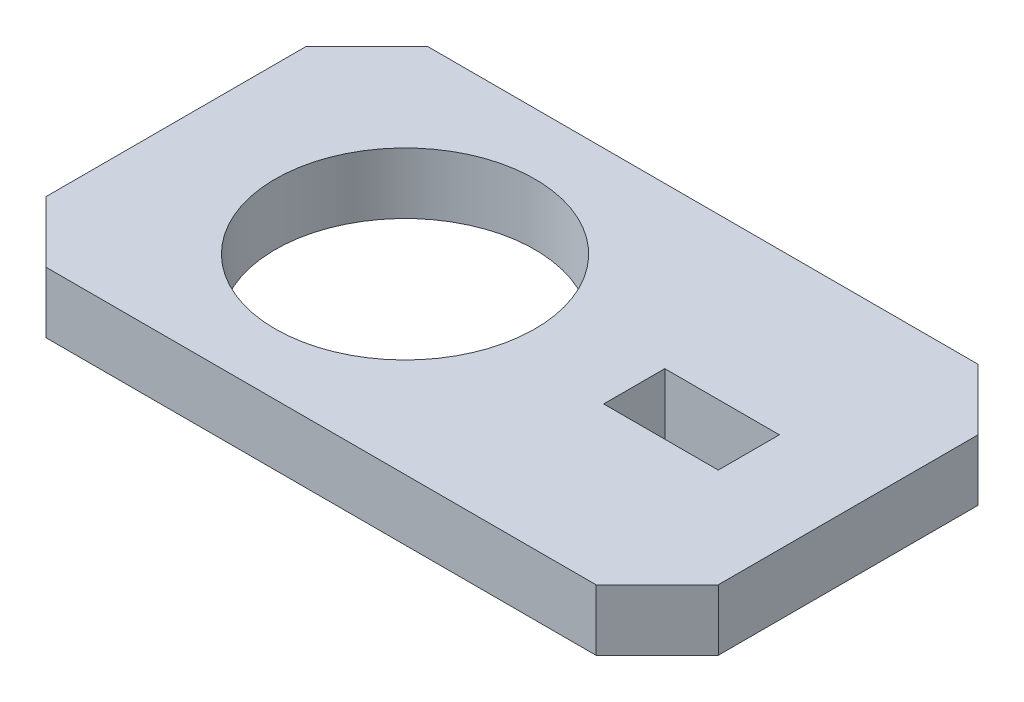
ISO-10303-21;
HEADER;
FILE_DESCRIPTION(('STEP AP214'),'2;1');
FILE_NAME('part.step','',(''),(''),'','','');
FILE_SCHEMA(('AUTOMOTIVE_DESIGN { 1 0 10303 214 1 1 1 1 }'));
ENDSEC;
DATA;
#1=APPLICATION_CONTEXT('core data for automotive mechanical design processes');
#2=APPLICATION_PROTOCOL_DEFINITION('international standard','automotive_design',2000,#1);
#3=PRODUCT_CONTEXT('',#1,'mechanical');
#4=PRODUCT('Part','Part','',(#3));
#5=PRODUCT_RELATED_PRODUCT_CATEGORY('part','',(#4));
#6=PRODUCT_DEFINITION_FORMATION('','',#4);
#7=PRODUCT_DEFINITION_CONTEXT('part definition',#1,'design');
#8=PRODUCT_DEFINITION('design','',#6,#7);
#9=PRODUCT_DEFINITION_SHAPE('','',#8);
#10=(LENGTH_UNIT() NAMED_UNIT(*) SI_UNIT(.MILLI.,.METRE.));
#11=(NAMED_UNIT(*) PLANE_ANGLE_UNIT() SI_UNIT($,.RADIAN.));
#12=(NAMED_UNIT(*) SI_UNIT($,.STERADIAN.) SOLID_ANGLE_UNIT());
#13=UNCERTAINTY_MEASURE_WITH_UNIT(LENGTH_MEASURE(1.E-05),#10,'distance_accuracy_value','');
#14=(GEOMETRIC_REPRESENTATION_CONTEXT(3) GLOBAL_UNCERTAINTY_ASSIGNED_CONTEXT((#13)) GLOBAL_UNIT_ASSIGNED_CONTEXT((#10,
#11,#12)) REPRESENTATION_CONTEXT('',''));
#15=CARTESIAN_POINT('',(0.,0.,0.));
#16=DIRECTION('',(0.,0.,1.));
#17=DIRECTION('',(1.,0.,0.));
#18=AXIS2_PLACEMENT_3D('',#15,#16,#17);
#19=CARTESIAN_POINT('',(0.,4.,0.));
#20=DIRECTION('',(0.,-1.,0.));
#21=DIRECTION('',(0.,0.,-1.));
#22=AXIS2_PLACEMENT_3D('',#19,#20,#21);
#23=PLANE('',#22);
#24=CARTESIAN_POINT('',(15.,4.,-12.5));
#25=DIRECTION('',(0.,1.,0.));
#26=DIRECTION('',(0.,0.,1.));
#27=AXIS2_PLACEMENT_3D('',#24,#25,#26);
#28=CIRCLE('',#27,8.5);
#29=CARTESIAN_POINT('',(15.,4.,-4.));
#30=VERTEX_POINT('',#29);
#31=EDGE_CURVE('E189',#30,#30,#28,.T.);
#32=ORIENTED_EDGE('',*,*,#31,.F.);
#33=EDGE_LOOP('',(#32));
#34=FACE_BOUND('',#33,.T.);
#35=DIRECTION('',(0.,0.,1.));
#36=VECTOR('',#35,1.);
#37=CARTESIAN_POINT('',(0.,4.,0.));
#38=LINE('',#37,#36);
#39=CARTESIAN_POINT('',(0.,4.,-21.));
#40=VERTEX_POINT('',#39);
#41=CARTESIAN_POINT('',(0.,4.,-4.00000000000002));
#42=VERTEX_POINT('',#41);
#43=EDGE_CURVE('E197',#40,#42,#38,.T.);
#44=ORIENTED_EDGE('',*,*,#43,.T.);
#45=DIRECTION('',(-0.707106781186546,0.,-0.707106781186549));
#46=VECTOR('',#45,1.);
#47=CARTESIAN_POINT('',(4.,4.,0.));
#48=LINE('',#47,#46);
#49=CARTESIAN_POINT('',(4.,4.,0.));
#50=VERTEX_POINT('',#49);
#51=EDGE_CURVE('E259',#42,#50,#48,.F.);
#52=ORIENTED_EDGE('',*,*,#51,.T.);
#53=DIRECTION('',(1.,0.,0.));
#54=VECTOR('',#53,1.);
#55=CARTESIAN_POINT('',(0.,4.,0.));
#56=LINE('',#55,#54);
#57=CARTESIAN_POINT('',(40.,4.,0.));
#58=VERTEX_POINT('',#57);
#59=EDGE_CURVE('E201',#50,#58,#56,.T.);
#60=ORIENTED_EDGE('',*,*,#59,.T.);
#61=DIRECTION('',(-0.707106781186549,0.,0.707106781186546));
#62=VECTOR('',#61,1.);
#63=CARTESIAN_POINT('',(44.,4.,-4.));
#64=LINE('',#63,#62);
#65=CARTESIAN_POINT('',(44.,4.,-4.));
#66=VERTEX_POINT('',#65);
#67=EDGE_CURVE('E251',#58,#66,#64,.F.);
#68=ORIENTED_EDGE('',*,*,#67,.T.);
#69=DIRECTION('',(0.,0.,-1.));
#70=VECTOR('',#69,1.);
#71=CARTESIAN_POINT('',(44.,4.,0.));
#72=LINE('',#71,#70);
#73=CARTESIAN_POINT('',(44.,4.,-21.));
#74=VERTEX_POINT('',#73);
#75=EDGE_CURVE('E206',#66,#74,#72,.T.);
#76=ORIENTED_EDGE('',*,*,#75,.T.);
#77=DIRECTION('',(0.707106781186546,0.,0.707106781186549));
#78=VECTOR('',#77,1.);
#79=CARTESIAN_POINT('',(40.,4.,-25.));
#80=LINE('',#79,#78);
#81=CARTESIAN_POINT('',(40.,4.,-25.));
#82=VERTEX_POINT('',#81);
#83=EDGE_CURVE('E66',#74,#82,#80,.F.);
#84=ORIENTED_EDGE('',*,*,#83,.T.);
#85=DIRECTION('',(-1.,0.,0.));
#86=VECTOR('',#85,1.);
#87=CARTESIAN_POINT('',(0.,4.,-25.));
#88=LINE('',#87,#86);
#89=CARTESIAN_POINT('',(4.00000000000002,4.,-25.));
#90=VERTEX_POINT('',#89);
#91=EDGE_CURVE('E209',#82,#90,#88,.T.);
#92=ORIENTED_EDGE('',*,*,#91,.T.);
#93=DIRECTION('',(0.707106781186549,0.,-0.707106781186546));
#94=VECTOR('',#93,1.);
#95=CARTESIAN_POINT('',(0.,4.,-21.));
#96=LINE('',#95,#94);
#97=EDGE_CURVE('E256',#90,#40,#96,.F.);
#98=ORIENTED_EDGE('',*,*,#97,.T.);
#99=EDGE_LOOP('',(#44,#52,#60,#68,#76,#84,#92,#98));
#100=FACE_BOUND('',#99,.T.);
#101=DIRECTION('',(0.,0.,1.));
#102=VECTOR('',#101,1.);
#103=CARTESIAN_POINT('',(30.,4.,-10.5));
#104=LINE('',#103,#102);
#105=CARTESIAN_POINT('',(30.,4.,-14.5));
#106=VERTEX_POINT('',#105);
#107=CARTESIAN_POINT('',(30.,4.,-10.5));
#108=VERTEX_POINT('',#107);
#109=EDGE_CURVE('E135',#106,#108,#104,.T.);
#110=ORIENTED_EDGE('',*,*,#109,.F.);
#111=DIRECTION('',(-1.,0.,0.));
#112=VECTOR('',#111,1.);
#113=CARTESIAN_POINT('',(30.,4.,-14.5));
#114=LINE('',#113,#112);
#115=CARTESIAN_POINT('',(37.5,4.,-14.5));
#116=VERTEX_POINT('',#115);
#117=EDGE_CURVE('E165',#116,#106,#114,.T.);
#118=ORIENTED_EDGE('',*,*,#117,.F.);
#119=DIRECTION('',(0.,0.,-1.));
#120=VECTOR('',#119,1.);
#121=CARTESIAN_POINT('',(37.5,4.,-10.5));
#122=LINE('',#121,#120);
#123=CARTESIAN_POINT('',(37.5,4.,-10.5));
#124=VERTEX_POINT('',#123);
#125=EDGE_CURVE('E160',#124,#116,#122,.T.);
#126=ORIENTED_EDGE('',*,*,#125,.F.);
#127=DIRECTION('',(1.,0.,0.));
#128=VECTOR('',#127,1.);
#129=CARTESIAN_POINT('',(30.,4.,-10.5));
#130=LINE('',#129,#128);
#131=EDGE_CURVE('E146',#108,#124,#130,.T.);
#132=ORIENTED_EDGE('',*,*,#131,.F.);
#133=EDGE_LOOP('',(#110,#118,#126,#132));
#134=FACE_BOUND('',#133,.T.);
#135=ADVANCED_FACE('F42',(#34,#100,#134),#23,.F.);
#136=CARTESIAN_POINT('',(0.,0.,0.));
#137=DIRECTION('',(0.,-1.,0.));
#138=DIRECTION('',(0.,0.,-1.));
#139=AXIS2_PLACEMENT_3D('',#136,#137,#138);
#140=PLANE('',#139);
#141=DIRECTION('',(1.,0.,0.));
#142=VECTOR('',#141,1.);
#143=CARTESIAN_POINT('',(0.,0.,0.));
#144=LINE('',#143,#142);
#145=CARTESIAN_POINT('',(4.,0.,0.));
#146=VERTEX_POINT('',#145);
#147=CARTESIAN_POINT('',(40.,0.,0.));
#148=VERTEX_POINT('',#147);
#149=EDGE_CURVE('E216',#146,#148,#144,.T.);
#150=ORIENTED_EDGE('',*,*,#149,.F.);
#151=DIRECTION('',(0.707106781186546,0.,0.707106781186549));
#152=VECTOR('',#151,1.);
#153=CARTESIAN_POINT('',(2.00000000000001,0.,-2.));
#154=LINE('',#153,#152);
#155=CARTESIAN_POINT('',(0.,0.,-4.00000000000002));
#156=VERTEX_POINT('',#155);
#157=EDGE_CURVE('E241',#146,#156,#154,.F.);
#158=ORIENTED_EDGE('',*,*,#157,.T.);
#159=DIRECTION('',(0.,0.,1.));
#160=VECTOR('',#159,1.);
#161=CARTESIAN_POINT('',(0.,0.,0.));
#162=LINE('',#161,#160);
#163=CARTESIAN_POINT('',(0.,0.,-21.));
#164=VERTEX_POINT('',#163);
#165=EDGE_CURVE('E193',#164,#156,#162,.T.);
#166=ORIENTED_EDGE('',*,*,#165,.F.);
#167=DIRECTION('',(-0.707106781186549,0.,0.707106781186546));
#168=VECTOR('',#167,1.);
#169=CARTESIAN_POINT('',(-10.5,0.,-10.5));
#170=LINE('',#169,#168);
#171=CARTESIAN_POINT('',(4.00000000000002,0.,-25.));
#172=VERTEX_POINT('',#171);
#173=EDGE_CURVE('E238',#164,#172,#170,.F.);
#174=ORIENTED_EDGE('',*,*,#173,.T.);
#175=DIRECTION('',(-1.,0.,0.));
#176=VECTOR('',#175,1.);
#177=CARTESIAN_POINT('',(0.,0.,-25.));
#178=LINE('',#177,#176);
#179=CARTESIAN_POINT('',(40.,0.,-25.));
#180=VERTEX_POINT('',#179);
#181=EDGE_CURVE('E202',#180,#172,#178,.T.);
#182=ORIENTED_EDGE('',*,*,#181,.F.);
#183=DIRECTION('',(-0.707106781186546,0.,-0.707106781186549));
#184=VECTOR('',#183,1.);
#185=CARTESIAN_POINT('',(32.5000000000001,0.,-32.5));
#186=LINE('',#185,#184);
#187=CARTESIAN_POINT('',(44.,0.,-21.));
#188=VERTEX_POINT('',#187);
#189=EDGE_CURVE('E235',#180,#188,#186,.F.);
#190=ORIENTED_EDGE('',*,*,#189,.T.);
#191=DIRECTION('',(0.,0.,-1.));
#192=VECTOR('',#191,1.);
#193=CARTESIAN_POINT('',(44.,0.,0.));
#194=LINE('',#193,#192);
#195=CARTESIAN_POINT('',(44.,0.,-4.));
#196=VERTEX_POINT('',#195);
#197=EDGE_CURVE('E220',#196,#188,#194,.T.);
#198=ORIENTED_EDGE('',*,*,#197,.F.);
#199=DIRECTION('',(0.707106781186549,0.,-0.707106781186546));
#200=VECTOR('',#199,1.);
#201=CARTESIAN_POINT('',(19.9999999999999,0.,20.));
#202=LINE('',#201,#200);
#203=EDGE_CURVE('E232',#196,#148,#202,.F.);
#204=ORIENTED_EDGE('',*,*,#203,.T.);
#205=EDGE_LOOP('',(#150,#158,#166,#174,#182,#190,#198,#204));
#206=FACE_BOUND('',#205,.T.);
#207=CARTESIAN_POINT('',(15.,0.,-12.5));
#208=DIRECTION('',(0.,1.,0.));
#209=DIRECTION('',(0.,0.,1.));
#210=AXIS2_PLACEMENT_3D('',#207,#208,#209);
#211=CIRCLE('',#210,8.5);
#212=CARTESIAN_POINT('',(15.,0.,-4.));
#213=VERTEX_POINT('',#212);
#214=EDGE_CURVE('E155',#213,#213,#211,.T.);
#215=ORIENTED_EDGE('',*,*,#214,.T.);
#216=EDGE_LOOP('',(#215));
#217=FACE_BOUND('',#216,.T.);
#218=DIRECTION('',(-1.,0.,0.));
#219=VECTOR('',#218,1.);
#220=CARTESIAN_POINT('',(30.,0.,-14.5));
#221=LINE('',#220,#219);
#222=CARTESIAN_POINT('',(37.5,0.,-14.5));
#223=VERTEX_POINT('',#222);
#224=CARTESIAN_POINT('',(30.,0.,-14.5));
#225=VERTEX_POINT('',#224);
#226=EDGE_CURVE('E147',#223,#225,#221,.T.);
#227=ORIENTED_EDGE('',*,*,#226,.T.);
#228=DIRECTION('',(0.,0.,1.));
#229=VECTOR('',#228,1.);
#230=CARTESIAN_POINT('',(30.,0.,-10.5));
#231=LINE('',#230,#229);
#232=CARTESIAN_POINT('',(30.,0.,-10.5));
#233=VERTEX_POINT('',#232);
#234=EDGE_CURVE('E170',#225,#233,#231,.T.);
#235=ORIENTED_EDGE('',*,*,#234,.T.);
#236=DIRECTION('',(1.,0.,0.));
#237=VECTOR('',#236,1.);
#238=CARTESIAN_POINT('',(30.,0.,-10.5));
#239=LINE('',#238,#237);
#240=CARTESIAN_POINT('',(37.5,0.,-10.5));
#241=VERTEX_POINT('',#240);
#242=EDGE_CURVE('E153',#233,#241,#239,.T.);
#243=ORIENTED_EDGE('',*,*,#242,.T.);
#244=DIRECTION('',(0.,0.,-1.));
#245=VECTOR('',#244,1.);
#246=CARTESIAN_POINT('',(37.5,0.,-10.5));
#247=LINE('',#246,#245);
#248=EDGE_CURVE('E175',#241,#223,#247,.T.);
#249=ORIENTED_EDGE('',*,*,#248,.T.);
#250=EDGE_LOOP('',(#227,#235,#243,#249));
#251=FACE_BOUND('',#250,.T.);
#252=ADVANCED_FACE('F280',(#206,#217,#251),#140,.T.);
#253=CARTESIAN_POINT('',(0.,4.,0.));
#254=DIRECTION('',(1.,0.,0.));
#255=DIRECTION('',(0.,0.,-1.));
#256=AXIS2_PLACEMENT_3D('',#253,#254,#255);
#257=PLANE('',#256);
#258=ORIENTED_EDGE('',*,*,#165,.T.);
#259=DIRECTION('',(0.,1.,0.));
#260=VECTOR('',#259,1.);
#261=CARTESIAN_POINT('',(0.,4.,-4.00000000000002));
#262=LINE('',#261,#260);
#263=EDGE_CURVE('E248',#156,#42,#262,.T.);
#264=ORIENTED_EDGE('',*,*,#263,.T.);
#265=ORIENTED_EDGE('',*,*,#43,.F.);
#266=DIRECTION('',(0.,-1.,0.));
#267=VECTOR('',#266,1.);
#268=CARTESIAN_POINT('',(0.,4.,-21.));
#269=LINE('',#268,#267);
#270=EDGE_CURVE('E244',#40,#164,#269,.T.);
#271=ORIENTED_EDGE('',*,*,#270,.T.);
#272=EDGE_LOOP('',(#258,#264,#265,#271));
#273=FACE_BOUND('',#272,.T.);
#274=ADVANCED_FACE('F294',(#273),#257,.F.);
#275=CARTESIAN_POINT('',(0.,4.,0.));
#276=DIRECTION('',(0.,0.,-1.));
#277=DIRECTION('',(-1.,0.,0.));
#278=AXIS2_PLACEMENT_3D('',#275,#276,#277);
#279=PLANE('',#278);
#280=ORIENTED_EDGE('',*,*,#59,.F.);
#281=DIRECTION('',(0.,-1.,0.));
#282=VECTOR('',#281,1.);
#283=CARTESIAN_POINT('',(4.,4.,0.));
#284=LINE('',#283,#282);
#285=EDGE_CURVE('E228',#50,#146,#284,.T.);
#286=ORIENTED_EDGE('',*,*,#285,.T.);
#287=ORIENTED_EDGE('',*,*,#149,.T.);
#288=DIRECTION('',(0.,1.,0.));
#289=VECTOR('',#288,1.);
#290=CARTESIAN_POINT('',(40.,4.,0.));
#291=LINE('',#290,#289);
#292=EDGE_CURVE('E212',#148,#58,#291,.T.);
#293=ORIENTED_EDGE('',*,*,#292,.T.);
#294=EDGE_LOOP('',(#280,#286,#287,#293));
#295=FACE_BOUND('',#294,.T.);
#296=ADVANCED_FACE('F302',(#295),#279,.F.);
#297=CARTESIAN_POINT('',(44.,4.,0.));
#298=DIRECTION('',(-1.,0.,0.));
#299=DIRECTION('',(0.,0.,1.));
#300=AXIS2_PLACEMENT_3D('',#297,#298,#299);
#301=PLANE('',#300);
#302=ORIENTED_EDGE('',*,*,#197,.T.);
#303=DIRECTION('',(0.,1.,0.));
#304=VECTOR('',#303,1.);
#305=CARTESIAN_POINT('',(44.,4.,-21.));
#306=LINE('',#305,#304);
#307=EDGE_CURVE('E11',#188,#74,#306,.T.);
#308=ORIENTED_EDGE('',*,*,#307,.T.);
#309=ORIENTED_EDGE('',*,*,#75,.F.);
#310=DIRECTION('',(0.,-1.,0.));
#311=VECTOR('',#310,1.);
#312=CARTESIAN_POINT('',(44.,4.,-4.));
#313=LINE('',#312,#311);
#314=EDGE_CURVE('E52',#66,#196,#313,.T.);
#315=ORIENTED_EDGE('',*,*,#314,.T.);
#316=EDGE_LOOP('',(#302,#308,#309,#315));
#317=FACE_BOUND('',#316,.T.);
#318=ADVANCED_FACE('F274',(#317),#301,.F.);
#319=CARTESIAN_POINT('',(0.,4.,-25.));
#320=DIRECTION('',(0.,0.,1.));
#321=DIRECTION('',(1.,0.,0.));
#322=AXIS2_PLACEMENT_3D('',#319,#320,#321);
#323=PLANE('',#322);
#324=ORIENTED_EDGE('',*,*,#181,.T.);
#325=DIRECTION('',(0.,1.,0.));
#326=VECTOR('',#325,1.);
#327=CARTESIAN_POINT('',(4.00000000000002,4.,-25.));
#328=LINE('',#327,#326);
#329=EDGE_CURVE('E59',#172,#90,#328,.T.);
#330=ORIENTED_EDGE('',*,*,#329,.T.);
#331=ORIENTED_EDGE('',*,*,#91,.F.);
#332=DIRECTION('',(0.,-1.,0.));
#333=VECTOR('',#332,1.);
#334=CARTESIAN_POINT('',(40.,4.,-25.));
#335=LINE('',#334,#333);
#336=EDGE_CURVE('E262',#82,#180,#335,.T.);
#337=ORIENTED_EDGE('',*,*,#336,.T.);
#338=EDGE_LOOP('',(#324,#330,#331,#337));
#339=FACE_BOUND('',#338,.T.);
#340=ADVANCED_FACE('F286',(#339),#323,.F.);
#341=CARTESIAN_POINT('',(15.,4.,-12.5));
#342=DIRECTION('',(0.,-1.,0.));
#343=DIRECTION('',(0.,0.,-1.));
#344=AXIS2_PLACEMENT_3D('',#341,#342,#343);
#345=CYLINDRICAL_SURFACE('',#344,8.5);
#346=ORIENTED_EDGE('',*,*,#31,.T.);
#347=EDGE_LOOP('',(#346));
#348=FACE_BOUND('',#347,.T.);
#349=ORIENTED_EDGE('',*,*,#214,.F.);
#350=EDGE_LOOP('',(#349));
#351=FACE_BOUND('',#350,.T.);
#352=ADVANCED_FACE('F317',(#348,#351),#345,.F.);
#353=CARTESIAN_POINT('',(30.,4.,-10.5));
#354=DIRECTION('',(1.,0.,0.));
#355=DIRECTION('',(0.,0.,-1.));
#356=AXIS2_PLACEMENT_3D('',#353,#354,#355);
#357=PLANE('',#356);
#358=ORIENTED_EDGE('',*,*,#234,.F.);
#359=DIRECTION('',(0.,-1.,0.));
#360=VECTOR('',#359,1.);
#361=CARTESIAN_POINT('',(30.,4.,-14.5));
#362=LINE('',#361,#360);
#363=EDGE_CURVE('E141',#106,#225,#362,.T.);
#364=ORIENTED_EDGE('',*,*,#363,.F.);
#365=ORIENTED_EDGE('',*,*,#109,.T.);
#366=DIRECTION('',(0.,-1.,0.));
#367=VECTOR('',#366,1.);
#368=CARTESIAN_POINT('',(30.,4.,-10.5));
#369=LINE('',#368,#367);
#370=EDGE_CURVE('E138',#108,#233,#369,.T.);
#371=ORIENTED_EDGE('',*,*,#370,.T.);
#372=EDGE_LOOP('',(#358,#364,#365,#371));
#373=FACE_BOUND('',#372,.T.);
#374=ADVANCED_FACE('F137',(#373),#357,.T.);
#375=CARTESIAN_POINT('',(30.,4.,-10.5));
#376=DIRECTION('',(0.,0.,-1.));
#377=DIRECTION('',(-1.,0.,0.));
#378=AXIS2_PLACEMENT_3D('',#375,#376,#377);
#379=PLANE('',#378);
#380=ORIENTED_EDGE('',*,*,#242,.F.);
#381=ORIENTED_EDGE('',*,*,#370,.F.);
#382=ORIENTED_EDGE('',*,*,#131,.T.);
#383=DIRECTION('',(0.,-1.,0.));
#384=VECTOR('',#383,1.);
#385=CARTESIAN_POINT('',(37.5,4.,-10.5));
#386=LINE('',#385,#384);
#387=EDGE_CURVE('E156',#124,#241,#386,.T.);
#388=ORIENTED_EDGE('',*,*,#387,.T.);
#389=EDGE_LOOP('',(#380,#381,#382,#388));
#390=FACE_BOUND('',#389,.T.);
#391=ADVANCED_FACE('F150',(#390),#379,.T.);
#392=CARTESIAN_POINT('',(37.5,4.,-10.5));
#393=DIRECTION('',(-1.,0.,0.));
#394=DIRECTION('',(0.,0.,1.));
#395=AXIS2_PLACEMENT_3D('',#392,#393,#394);
#396=PLANE('',#395);
#397=ORIENTED_EDGE('',*,*,#248,.F.);
#398=ORIENTED_EDGE('',*,*,#387,.F.);
#399=ORIENTED_EDGE('',*,*,#125,.T.);
#400=DIRECTION('',(0.,-1.,0.));
#401=VECTOR('',#400,1.);
#402=CARTESIAN_POINT('',(37.5,4.,-14.5));
#403=LINE('',#402,#401);
#404=EDGE_CURVE('E184',#116,#223,#403,.T.);
#405=ORIENTED_EDGE('',*,*,#404,.T.);
#406=EDGE_LOOP('',(#397,#398,#399,#405));
#407=FACE_BOUND('',#406,.T.);
#408=ADVANCED_FACE('F379',(#407),#396,.T.);
#409=CARTESIAN_POINT('',(30.,4.,-14.5));
#410=DIRECTION('',(0.,0.,1.));
#411=DIRECTION('',(1.,0.,0.));
#412=AXIS2_PLACEMENT_3D('',#409,#410,#411);
#413=PLANE('',#412);
#414=ORIENTED_EDGE('',*,*,#226,.F.);
#415=ORIENTED_EDGE('',*,*,#404,.F.);
#416=ORIENTED_EDGE('',*,*,#117,.T.);
#417=ORIENTED_EDGE('',*,*,#363,.T.);
#418=EDGE_LOOP('',(#414,#415,#416,#417));
#419=FACE_BOUND('',#418,.T.);
#420=ADVANCED_FACE('F334',(#419),#413,.T.);
#421=CARTESIAN_POINT('',(4.,4.,0.));
#422=DIRECTION('',(0.707106781186549,0.,-0.707106781186546));
#423=DIRECTION('',(0.,-1.,0.));
#424=AXIS2_PLACEMENT_3D('',#421,#422,#423);
#425=PLANE('',#424);
#426=ORIENTED_EDGE('',*,*,#51,.F.);
#427=ORIENTED_EDGE('',*,*,#263,.F.);
#428=ORIENTED_EDGE('',*,*,#157,.F.);
#429=ORIENTED_EDGE('',*,*,#285,.F.);
#430=EDGE_LOOP('',(#426,#427,#428,#429));
#431=FACE_BOUND('',#430,.T.);
#432=ADVANCED_FACE('F299',(#431),#425,.F.);
#433=CARTESIAN_POINT('',(0.,4.,-21.));
#434=DIRECTION('',(0.707106781186546,0.,0.707106781186549));
#435=DIRECTION('',(0.,-1.,0.));
#436=AXIS2_PLACEMENT_3D('',#433,#434,#435);
#437=PLANE('',#436);
#438=ORIENTED_EDGE('',*,*,#97,.F.);
#439=ORIENTED_EDGE('',*,*,#329,.F.);
#440=ORIENTED_EDGE('',*,*,#173,.F.);
#441=ORIENTED_EDGE('',*,*,#270,.F.);
#442=EDGE_LOOP('',(#438,#439,#440,#441));
#443=FACE_BOUND('',#442,.T.);
#444=ADVANCED_FACE('F291',(#443),#437,.F.);
#445=CARTESIAN_POINT('',(40.,4.,-25.));
#446=DIRECTION('',(-0.707106781186549,0.,0.707106781186546));
#447=DIRECTION('',(0.,-1.,0.));
#448=AXIS2_PLACEMENT_3D('',#445,#446,#447);
#449=PLANE('',#448);
#450=ORIENTED_EDGE('',*,*,#83,.F.);
#451=ORIENTED_EDGE('',*,*,#307,.F.);
#452=ORIENTED_EDGE('',*,*,#189,.F.);
#453=ORIENTED_EDGE('',*,*,#336,.F.);
#454=EDGE_LOOP('',(#450,#451,#452,#453));
#455=FACE_BOUND('',#454,.T.);
#456=ADVANCED_FACE('F285',(#455),#449,.F.);
#457=CARTESIAN_POINT('',(44.,4.,-4.));
#458=DIRECTION('',(-0.707106781186546,0.,-0.707106781186549));
#459=DIRECTION('',(0.,-1.,0.));
#460=AXIS2_PLACEMENT_3D('',#457,#458,#459);
#461=PLANE('',#460);
#462=ORIENTED_EDGE('',*,*,#67,.F.);
#463=ORIENTED_EDGE('',*,*,#292,.F.);
#464=ORIENTED_EDGE('',*,*,#203,.F.);
#465=ORIENTED_EDGE('',*,*,#314,.F.);
#466=EDGE_LOOP('',(#462,#463,#464,#465));
#467=FACE_BOUND('',#466,.T.);
#468=ADVANCED_FACE('F45',(#467),#461,.F.);
#469=CLOSED_SHELL('',(#135,#252,#274,#296,#318,#340,#352,#374,#391,#408,#420,#432,#444,#456,#468));
#470=MANIFOLD_SOLID_BREP('B2',#469);
#471=ADVANCED_BREP_SHAPE_REPRESENTATION('',(#18,#470),#14);
#472=SHAPE_DEFINITION_REPRESENTATION(#9,#471);
ENDSEC;
END-ISO-10303-21;
